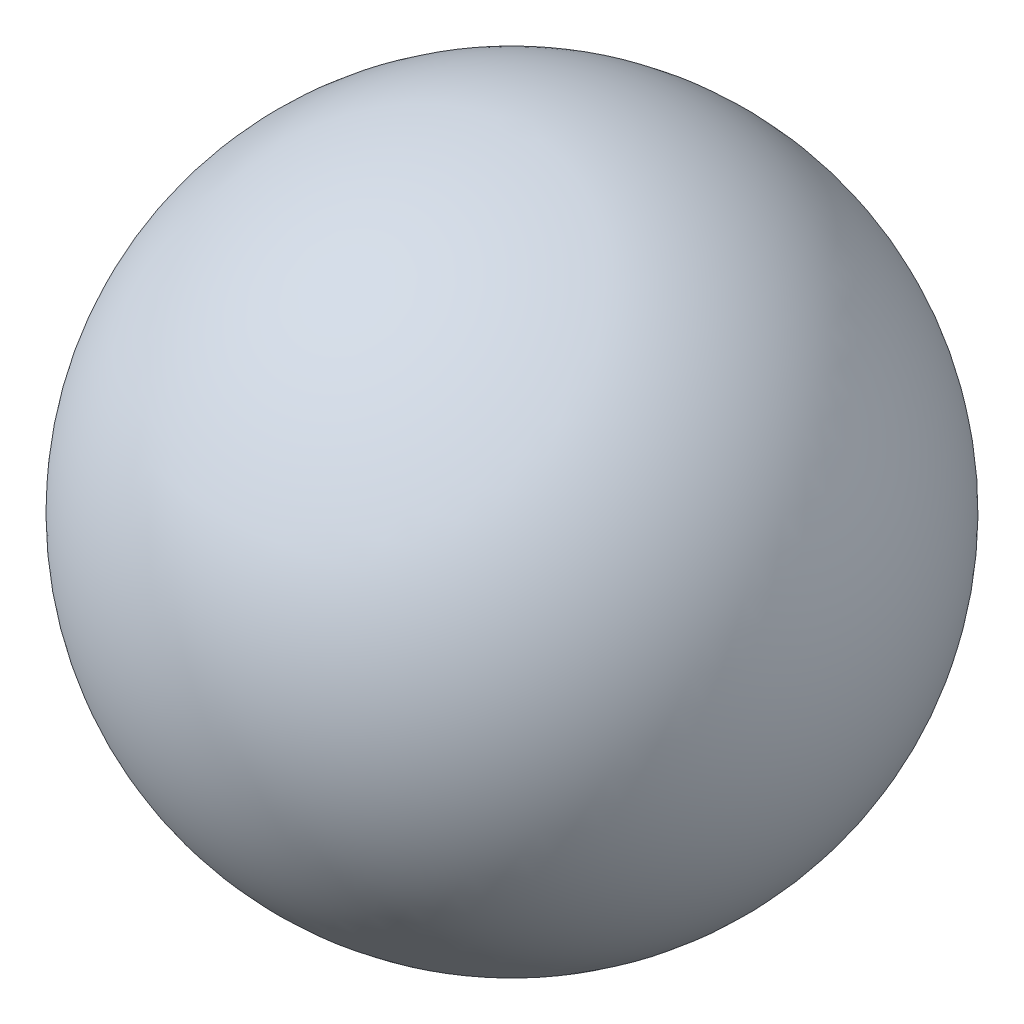
ISO-10303-21;
HEADER;
FILE_DESCRIPTION(('STEP AP214'),'2;1');
FILE_NAME('part.step','',(''),(''),'','','');
FILE_SCHEMA(('AUTOMOTIVE_DESIGN { 1 0 10303 214 1 1 1 1 }'));
ENDSEC;
DATA;
#1=APPLICATION_CONTEXT('core data for automotive mechanical design processes');
#2=APPLICATION_PROTOCOL_DEFINITION('international standard','automotive_design',2000,#1);
#3=PRODUCT_CONTEXT('',#1,'mechanical');
#4=PRODUCT('Part','Part','',(#3));
#5=PRODUCT_RELATED_PRODUCT_CATEGORY('part','',(#4));
#6=PRODUCT_DEFINITION_FORMATION('','',#4);
#7=PRODUCT_DEFINITION_CONTEXT('part definition',#1,'design');
#8=PRODUCT_DEFINITION('design','',#6,#7);
#9=PRODUCT_DEFINITION_SHAPE('','',#8);
#10=(LENGTH_UNIT() NAMED_UNIT(*) SI_UNIT(.MILLI.,.METRE.));
#11=(NAMED_UNIT(*) PLANE_ANGLE_UNIT() SI_UNIT($,.RADIAN.));
#12=(NAMED_UNIT(*) SI_UNIT($,.STERADIAN.) SOLID_ANGLE_UNIT());
#13=UNCERTAINTY_MEASURE_WITH_UNIT(LENGTH_MEASURE(1.E-05),#10,'distance_accuracy_value','');
#14=(GEOMETRIC_REPRESENTATION_CONTEXT(3) GLOBAL_UNCERTAINTY_ASSIGNED_CONTEXT((#13)) GLOBAL_UNIT_ASSIGNED_CONTEXT((#10,
#11,#12)) REPRESENTATION_CONTEXT('',''));
#15=CARTESIAN_POINT('',(0.,0.,0.));
#16=DIRECTION('',(0.,0.,1.));
#17=DIRECTION('',(1.,0.,0.));
#18=AXIS2_PLACEMENT_3D('',#15,#16,#17);
#19=CARTESIAN_POINT('',(57.535,-61.422361631586,3.6631931219458));
#20=DIRECTION('',(0.,-0.998226300863558,0.059533622972718));
#21=DIRECTION('',(0.173648177666934,-0.0586291734684383,-0.983061000351128));
#22=AXIS2_PLACEMENT_3D('',#19,#20,#21);
#23=SPHERICAL_SURFACE('',#22,6.75);
#24=CARTESIAN_POINT('',(57.535,-68.160389162415,4.06504507701164));
#25=VERTEX_POINT('',#24);
#26=VERTEX_LOOP('',#25);
#27=FACE_BOUND('',#26,.T.);
#28=CARTESIAN_POINT('',(57.535,-54.684334100757,3.26134116687995));
#29=VERTEX_POINT('',#28);
#30=VERTEX_LOOP('',#29);
#31=FACE_BOUND('',#30,.T.);
#32=ADVANCED_FACE('F16',(#27,#31),#23,.T.);
#33=CLOSED_SHELL('',(#32));
#34=MANIFOLD_SOLID_BREP('B1',#33);
#35=ADVANCED_BREP_SHAPE_REPRESENTATION('',(#18,#34),#14);
#36=SHAPE_DEFINITION_REPRESENTATION(#9,#35);
ENDSEC;
END-ISO-10303-21;
